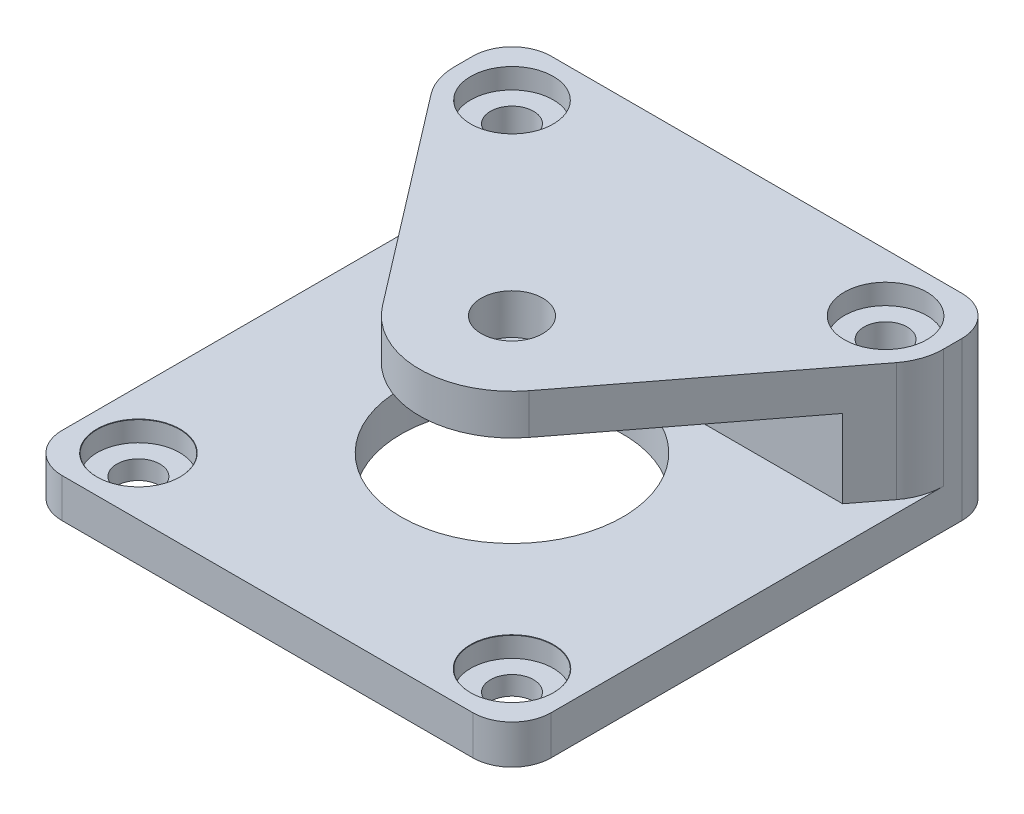
ISO-10303-21;
HEADER;
FILE_DESCRIPTION(('STEP AP214'),'2;1');
FILE_NAME('part.step','',(''),(''),'','','');
FILE_SCHEMA(('AUTOMOTIVE_DESIGN { 1 0 10303 214 1 1 1 1 }'));
ENDSEC;
DATA;
#1=APPLICATION_CONTEXT('core data for automotive mechanical design processes');
#2=APPLICATION_PROTOCOL_DEFINITION('international standard','automotive_design',2000,#1);
#3=PRODUCT_CONTEXT('',#1,'mechanical');
#4=PRODUCT('Part','Part','',(#3));
#5=PRODUCT_RELATED_PRODUCT_CATEGORY('part','',(#4));
#6=PRODUCT_DEFINITION_FORMATION('','',#4);
#7=PRODUCT_DEFINITION_CONTEXT('part definition',#1,'design');
#8=PRODUCT_DEFINITION('design','',#6,#7);
#9=PRODUCT_DEFINITION_SHAPE('','',#8);
#10=(LENGTH_UNIT() NAMED_UNIT(*) SI_UNIT(.MILLI.,.METRE.));
#11=(NAMED_UNIT(*) PLANE_ANGLE_UNIT() SI_UNIT($,.RADIAN.));
#12=(NAMED_UNIT(*) SI_UNIT($,.STERADIAN.) SOLID_ANGLE_UNIT());
#13=UNCERTAINTY_MEASURE_WITH_UNIT(LENGTH_MEASURE(1.E-05),#10,'distance_accuracy_value','');
#14=(GEOMETRIC_REPRESENTATION_CONTEXT(3) GLOBAL_UNCERTAINTY_ASSIGNED_CONTEXT((#13)) GLOBAL_UNIT_ASSIGNED_CONTEXT((#10,
#11,#12)) REPRESENTATION_CONTEXT('',''));
#15=CARTESIAN_POINT('',(0.,0.,0.));
#16=DIRECTION('',(0.,0.,1.));
#17=DIRECTION('',(1.,0.,0.));
#18=AXIS2_PLACEMENT_3D('',#15,#16,#17);
#19=CARTESIAN_POINT('',(0.,3.175,0.));
#20=DIRECTION('',(0.,-1.,0.));
#21=DIRECTION('',(0.,0.,-1.));
#22=AXIS2_PLACEMENT_3D('',#19,#20,#21);
#23=PLANE('',#22);
#24=CARTESIAN_POINT('',(35.005,3.175,-4.685));
#25=DIRECTION('',(0.,1.,0.));
#26=DIRECTION('',(0.,0.,1.));
#27=AXIS2_PLACEMENT_3D('',#24,#25,#26);
#28=CIRCLE('',#27,3.375);
#29=CARTESIAN_POINT('',(35.005,3.175,-1.30999999999999));
#30=VERTEX_POINT('',#29);
#31=EDGE_CURVE('E249',#30,#30,#28,.T.);
#32=ORIENTED_EDGE('',*,*,#31,.F.);
#33=EDGE_LOOP('',(#32));
#34=FACE_BOUND('',#33,.T.);
#35=DIRECTION('',(1.,0.,0.));
#36=VECTOR('',#35,1.);
#37=CARTESIAN_POINT('',(0.,3.175,0.));
#38=LINE('',#37,#36);
#39=CARTESIAN_POINT('',(3.175,3.175,0.));
#40=VERTEX_POINT('',#39);
#41=CARTESIAN_POINT('',(36.515,3.175,0.));
#42=VERTEX_POINT('',#41);
#43=EDGE_CURVE('E176',#40,#42,#38,.T.);
#44=ORIENTED_EDGE('',*,*,#43,.T.);
#45=CARTESIAN_POINT('',(36.515,3.175,-3.175));
#46=DIRECTION('',(0.,-1.,0.));
#47=DIRECTION('',(0.,0.,-1.));
#48=AXIS2_PLACEMENT_3D('',#45,#46,#47);
#49=CIRCLE('',#48,3.175);
#50=CARTESIAN_POINT('',(39.69,3.175,-3.175));
#51=VERTEX_POINT('',#50);
#52=EDGE_CURVE('E11',#42,#51,#49,.F.);
#53=ORIENTED_EDGE('',*,*,#52,.T.);
#54=DIRECTION('',(0.,0.,-1.));
#55=VECTOR('',#54,1.);
#56=CARTESIAN_POINT('',(39.69,3.175,0.));
#57=LINE('',#56,#55);
#58=CARTESIAN_POINT('',(39.69,3.175,-35.005));
#59=VERTEX_POINT('',#58);
#60=EDGE_CURVE('E173',#51,#59,#57,.T.);
#61=ORIENTED_EDGE('',*,*,#60,.T.);
#62=CARTESIAN_POINT('',(35.005,3.175,-35.005));
#63=DIRECTION('',(0.,1.,0.));
#64=DIRECTION('',(0.,0.,1.));
#65=AXIS2_PLACEMENT_3D('',#62,#63,#64);
#66=CIRCLE('',#65,4.68499999999999);
#67=CARTESIAN_POINT('',(38.724084904331,3.175,-32.1558540798378));
#68=VERTEX_POINT('',#67);
#69=EDGE_CURVE('E171',#68,#59,#66,.T.);
#70=ORIENTED_EDGE('',*,*,#69,.F.);
#71=DIRECTION('',(0.60814213877528,0.,-0.793828154606416));
#72=VECTOR('',#71,1.);
#73=CARTESIAN_POINT('',(25.7987111595481,3.175,-15.2839339591854));
#74=LINE('',#73,#72);
#75=CARTESIAN_POINT('',(36.8350239465929,3.175,-29.69));
#76=VERTEX_POINT('',#75);
#77=EDGE_CURVE('E163',#76,#68,#74,.T.);
#78=ORIENTED_EDGE('',*,*,#77,.F.);
#79=DIRECTION('',(-1.,0.,0.));
#80=VECTOR('',#79,1.);
#81=CARTESIAN_POINT('',(39.69,3.175,-29.69));
#82=LINE('',#81,#80);
#83=CARTESIAN_POINT('',(2.85497605340711,3.175,-29.69));
#84=VERTEX_POINT('',#83);
#85=EDGE_CURVE('E146',#76,#84,#82,.T.);
#86=ORIENTED_EDGE('',*,*,#85,.T.);
#87=DIRECTION('',(0.608142138775281,0.,0.793828154606415));
#88=VECTOR('',#87,1.);
#89=CARTESIAN_POINT('',(13.8912888404519,3.175,-15.2839339591854));
#90=LINE('',#89,#88);
#91=CARTESIAN_POINT('',(0.965915095668944,3.175,-32.1558540798378));
#92=VERTEX_POINT('',#91);
#93=EDGE_CURVE('E180',#92,#84,#90,.T.);
#94=ORIENTED_EDGE('',*,*,#93,.F.);
#95=CARTESIAN_POINT('',(4.685,3.175,-35.005));
#96=DIRECTION('',(0.,1.,0.));
#97=DIRECTION('',(0.,0.,1.));
#98=AXIS2_PLACEMENT_3D('',#95,#96,#97);
#99=CIRCLE('',#98,4.685);
#100=CARTESIAN_POINT('',(0.,3.175,-35.005));
#101=VERTEX_POINT('',#100);
#102=EDGE_CURVE('E320',#101,#92,#99,.T.);
#103=ORIENTED_EDGE('',*,*,#102,.F.);
#104=DIRECTION('',(0.,0.,1.));
#105=VECTOR('',#104,1.);
#106=CARTESIAN_POINT('',(0.,3.175,0.));
#107=LINE('',#106,#105);
#108=CARTESIAN_POINT('',(0.,3.175,-3.175));
#109=VERTEX_POINT('',#108);
#110=EDGE_CURVE('E220',#101,#109,#107,.T.);
#111=ORIENTED_EDGE('',*,*,#110,.T.);
#112=CARTESIAN_POINT('',(3.175,3.175,-3.175));
#113=DIRECTION('',(0.,-1.,0.));
#114=DIRECTION('',(0.,0.,-1.));
#115=AXIS2_PLACEMENT_3D('',#112,#113,#114);
#116=CIRCLE('',#115,3.175);
#117=EDGE_CURVE('E42',#109,#40,#116,.F.);
#118=ORIENTED_EDGE('',*,*,#117,.T.);
#119=EDGE_LOOP('',(#44,#53,#61,#70,#78,#86,#94,#103,#111,#118));
#120=FACE_BOUND('',#119,.T.);
#121=CARTESIAN_POINT('',(19.845,3.175,-19.845));
#122=DIRECTION('',(0.,1.,0.));
#123=DIRECTION('',(0.,0.,1.));
#124=AXIS2_PLACEMENT_3D('',#121,#122,#123);
#125=CIRCLE('',#124,9.);
#126=CARTESIAN_POINT('',(19.845,3.175,-10.845));
#127=VERTEX_POINT('',#126);
#128=EDGE_CURVE('E202',#127,#127,#125,.T.);
#129=ORIENTED_EDGE('',*,*,#128,.F.);
#130=EDGE_LOOP('',(#129));
#131=FACE_BOUND('',#130,.T.);
#132=CARTESIAN_POINT('',(4.68499999999999,3.175,-4.685));
#133=DIRECTION('',(0.,1.,0.));
#134=DIRECTION('',(0.,0.,1.));
#135=AXIS2_PLACEMENT_3D('',#132,#133,#134);
#136=CIRCLE('',#135,3.375);
#137=CARTESIAN_POINT('',(4.68499999999999,3.175,-1.31));
#138=VERTEX_POINT('',#137);
#139=EDGE_CURVE('E364',#138,#138,#136,.T.);
#140=ORIENTED_EDGE('',*,*,#139,.F.);
#141=EDGE_LOOP('',(#140));
#142=FACE_BOUND('',#141,.T.);
#143=ADVANCED_FACE('F34',(#34,#120,#131,#142),#23,.F.);
#144=CARTESIAN_POINT('',(13.8912888404519,12.81,-15.2839339591854));
#145=DIRECTION('',(0.793828154606415,0.,-0.608142138775281));
#146=DIRECTION('',(-0.608142138775281,0.,-0.793828154606415));
#147=AXIS2_PLACEMENT_3D('',#144,#145,#146);
#148=PLANE('',#147);
#149=DIRECTION('',(0.,-1.,0.));
#150=VECTOR('',#149,1.);
#151=CARTESIAN_POINT('',(2.85497605340711,12.81,-29.69));
#152=LINE('',#151,#150);
#153=CARTESIAN_POINT('',(2.85497605340711,9.525,-29.69));
#154=VERTEX_POINT('',#153);
#155=EDGE_CURVE('E153',#154,#84,#152,.T.);
#156=ORIENTED_EDGE('',*,*,#155,.F.);
#157=DIRECTION('',(-0.608142138775281,0.,-0.793828154606415));
#158=VECTOR('',#157,1.);
#159=CARTESIAN_POINT('',(13.8912888404519,9.525,-15.2839339591854));
#160=LINE('',#159,#158);
#161=CARTESIAN_POINT('',(13.8912888404519,9.525,-15.2839339591854));
#162=VERTEX_POINT('',#161);
#163=EDGE_CURVE('E324',#162,#154,#160,.T.);
#164=ORIENTED_EDGE('',*,*,#163,.F.);
#165=DIRECTION('',(0.,-1.,0.));
#166=VECTOR('',#165,1.);
#167=CARTESIAN_POINT('',(13.8912888404519,12.81,-15.2839339591854));
#168=LINE('',#167,#166);
#169=CARTESIAN_POINT('',(13.8912888404519,12.81,-15.2839339591854));
#170=VERTEX_POINT('',#169);
#171=EDGE_CURVE('E195',#170,#162,#168,.T.);
#172=ORIENTED_EDGE('',*,*,#171,.F.);
#173=DIRECTION('',(0.608142138775281,0.,0.793828154606415));
#174=VECTOR('',#173,1.);
#175=CARTESIAN_POINT('',(13.8912888404519,12.81,-15.2839339591854));
#176=LINE('',#175,#174);
#177=CARTESIAN_POINT('',(0.965915095668944,12.81,-32.1558540798378));
#178=VERTEX_POINT('',#177);
#179=EDGE_CURVE('E311',#178,#170,#176,.T.);
#180=ORIENTED_EDGE('',*,*,#179,.F.);
#181=DIRECTION('',(0.,-1.,0.));
#182=VECTOR('',#181,1.);
#183=CARTESIAN_POINT('',(0.965915095668944,12.81,-32.1558540798378));
#184=LINE('',#183,#182);
#185=EDGE_CURVE('E198',#178,#92,#184,.T.);
#186=ORIENTED_EDGE('',*,*,#185,.T.);
#187=ORIENTED_EDGE('',*,*,#93,.T.);
#188=EDGE_LOOP('',(#156,#164,#172,#180,#186,#187));
#189=FACE_BOUND('',#188,.T.);
#190=ADVANCED_FACE('F337',(#189),#148,.F.);
#191=CARTESIAN_POINT('',(19.845,12.81,-19.845));
#192=DIRECTION('',(0.,-1.,0.));
#193=DIRECTION('',(0.,0.,-1.));
#194=AXIS2_PLACEMENT_3D('',#191,#192,#193);
#195=CYLINDRICAL_SURFACE('',#194,7.49999999999999);
#196=CARTESIAN_POINT('',(19.845,9.525,-19.845));
#197=DIRECTION('',(0.,-1.,0.));
#198=DIRECTION('',(0.,0.,-1.));
#199=AXIS2_PLACEMENT_3D('',#196,#197,#198);
#200=CIRCLE('',#199,7.49999999999999);
#201=CARTESIAN_POINT('',(25.7987111595481,9.525,-15.2839339591854));
#202=VERTEX_POINT('',#201);
#203=EDGE_CURVE('E326',#202,#162,#200,.T.);
#204=ORIENTED_EDGE('',*,*,#203,.F.);
#205=DIRECTION('',(0.,-1.,0.));
#206=VECTOR('',#205,1.);
#207=CARTESIAN_POINT('',(25.7987111595481,12.81,-15.2839339591854));
#208=LINE('',#207,#206);
#209=CARTESIAN_POINT('',(25.7987111595481,12.81,-15.2839339591854));
#210=VERTEX_POINT('',#209);
#211=EDGE_CURVE('E193',#210,#202,#208,.T.);
#212=ORIENTED_EDGE('',*,*,#211,.F.);
#213=CARTESIAN_POINT('',(19.845,12.81,-19.845));
#214=DIRECTION('',(0.,1.,0.));
#215=DIRECTION('',(0.,0.,1.));
#216=AXIS2_PLACEMENT_3D('',#213,#214,#215);
#217=CIRCLE('',#216,7.49999999999999);
#218=EDGE_CURVE('E307',#170,#210,#217,.T.);
#219=ORIENTED_EDGE('',*,*,#218,.F.);
#220=ORIENTED_EDGE('',*,*,#171,.T.);
#221=EDGE_LOOP('',(#204,#212,#219,#220));
#222=FACE_BOUND('',#221,.T.);
#223=ADVANCED_FACE('F340',(#222),#195,.T.);
#224=CARTESIAN_POINT('',(25.7987111595481,12.81,-15.2839339591854));
#225=DIRECTION('',(-0.793828154606416,0.,-0.60814213877528));
#226=DIRECTION('',(-0.60814213877528,0.,0.793828154606416));
#227=AXIS2_PLACEMENT_3D('',#224,#225,#226);
#228=PLANE('',#227);
#229=DIRECTION('',(0.,1.,0.));
#230=VECTOR('',#229,1.);
#231=CARTESIAN_POINT('',(36.8350239465929,12.81,-29.69));
#232=LINE('',#231,#230);
#233=CARTESIAN_POINT('',(36.8350239465929,9.525,-29.69));
#234=VERTEX_POINT('',#233);
#235=EDGE_CURVE('E150',#76,#234,#232,.T.);
#236=ORIENTED_EDGE('',*,*,#235,.F.);
#237=ORIENTED_EDGE('',*,*,#77,.T.);
#238=DIRECTION('',(0.,-1.,0.));
#239=VECTOR('',#238,1.);
#240=CARTESIAN_POINT('',(38.724084904331,12.81,-32.1558540798378));
#241=LINE('',#240,#239);
#242=CARTESIAN_POINT('',(38.724084904331,12.81,-32.1558540798378));
#243=VERTEX_POINT('',#242);
#244=EDGE_CURVE('E191',#243,#68,#241,.T.);
#245=ORIENTED_EDGE('',*,*,#244,.F.);
#246=DIRECTION('',(0.60814213877528,0.,-0.793828154606416));
#247=VECTOR('',#246,1.);
#248=CARTESIAN_POINT('',(25.7987111595481,12.81,-15.2839339591854));
#249=LINE('',#248,#247);
#250=EDGE_CURVE('E304',#210,#243,#249,.T.);
#251=ORIENTED_EDGE('',*,*,#250,.F.);
#252=ORIENTED_EDGE('',*,*,#211,.T.);
#253=DIRECTION('',(-0.60814213877528,0.,0.793828154606416));
#254=VECTOR('',#253,1.);
#255=CARTESIAN_POINT('',(25.7987111595481,9.525,-15.2839339591854));
#256=LINE('',#255,#254);
#257=EDGE_CURVE('E166',#234,#202,#256,.T.);
#258=ORIENTED_EDGE('',*,*,#257,.F.);
#259=EDGE_LOOP('',(#236,#237,#245,#251,#252,#258));
#260=FACE_BOUND('',#259,.T.);
#261=ADVANCED_FACE('F161',(#260),#228,.F.);
#262=CARTESIAN_POINT('',(0.,0.,0.));
#263=DIRECTION('',(0.,-1.,0.));
#264=DIRECTION('',(0.,0.,-1.));
#265=AXIS2_PLACEMENT_3D('',#262,#263,#264);
#266=PLANE('',#265);
#267=CARTESIAN_POINT('',(4.685,0.,-35.005));
#268=DIRECTION('',(0.,1.,0.));
#269=DIRECTION('',(0.,0.,1.));
#270=AXIS2_PLACEMENT_3D('',#267,#268,#269);
#271=CIRCLE('',#270,1.75);
#272=CARTESIAN_POINT('',(4.685,0.,-33.255));
#273=VERTEX_POINT('',#272);
#274=EDGE_CURVE('E205',#273,#273,#271,.T.);
#275=ORIENTED_EDGE('',*,*,#274,.T.);
#276=EDGE_LOOP('',(#275));
#277=FACE_BOUND('',#276,.T.);
#278=CARTESIAN_POINT('',(35.005,0.,-4.685));
#279=DIRECTION('',(0.,1.,0.));
#280=DIRECTION('',(0.,0.,1.));
#281=AXIS2_PLACEMENT_3D('',#278,#279,#280);
#282=CIRCLE('',#281,1.75);
#283=CARTESIAN_POINT('',(35.005,0.,-2.93499999999999));
#284=VERTEX_POINT('',#283);
#285=EDGE_CURVE('E213',#284,#284,#282,.T.);
#286=ORIENTED_EDGE('',*,*,#285,.T.);
#287=EDGE_LOOP('',(#286));
#288=FACE_BOUND('',#287,.T.);
#289=DIRECTION('',(0.,0.,1.));
#290=VECTOR('',#289,1.);
#291=CARTESIAN_POINT('',(0.,0.,0.));
#292=LINE('',#291,#290);
#293=CARTESIAN_POINT('',(0.,0.,-36.515));
#294=VERTEX_POINT('',#293);
#295=CARTESIAN_POINT('',(0.,0.,-3.175));
#296=VERTEX_POINT('',#295);
#297=EDGE_CURVE('E219',#294,#296,#292,.T.);
#298=ORIENTED_EDGE('',*,*,#297,.F.);
#299=CARTESIAN_POINT('',(3.175,0.,-36.515));
#300=DIRECTION('',(0.,-1.,0.));
#301=DIRECTION('',(0.,0.,-1.));
#302=AXIS2_PLACEMENT_3D('',#299,#300,#301);
#303=CIRCLE('',#302,3.175);
#304=CARTESIAN_POINT('',(3.175,0.,-39.69));
#305=VERTEX_POINT('',#304);
#306=EDGE_CURVE('E261',#294,#305,#303,.T.);
#307=ORIENTED_EDGE('',*,*,#306,.T.);
#308=DIRECTION('',(-1.,0.,0.));
#309=VECTOR('',#308,1.);
#310=CARTESIAN_POINT('',(0.,0.,-39.69));
#311=LINE('',#310,#309);
#312=CARTESIAN_POINT('',(36.515,0.,-39.69));
#313=VERTEX_POINT('',#312);
#314=EDGE_CURVE('E222',#313,#305,#311,.T.);
#315=ORIENTED_EDGE('',*,*,#314,.F.);
#316=CARTESIAN_POINT('',(36.515,0.,-36.515));
#317=DIRECTION('',(0.,-1.,0.));
#318=DIRECTION('',(0.,0.,-1.));
#319=AXIS2_PLACEMENT_3D('',#316,#317,#318);
#320=CIRCLE('',#319,3.175);
#321=CARTESIAN_POINT('',(39.69,0.,-36.515));
#322=VERTEX_POINT('',#321);
#323=EDGE_CURVE('E259',#313,#322,#320,.T.);
#324=ORIENTED_EDGE('',*,*,#323,.T.);
#325=DIRECTION('',(0.,0.,-1.));
#326=VECTOR('',#325,1.);
#327=CARTESIAN_POINT('',(39.69,0.,0.));
#328=LINE('',#327,#326);
#329=CARTESIAN_POINT('',(39.69,0.,-3.175));
#330=VERTEX_POINT('',#329);
#331=EDGE_CURVE('E228',#330,#322,#328,.T.);
#332=ORIENTED_EDGE('',*,*,#331,.F.);
#333=CARTESIAN_POINT('',(36.515,0.,-3.175));
#334=DIRECTION('',(0.,-1.,0.));
#335=DIRECTION('',(0.,0.,-1.));
#336=AXIS2_PLACEMENT_3D('',#333,#334,#335);
#337=CIRCLE('',#336,3.175);
#338=CARTESIAN_POINT('',(36.515,0.,0.));
#339=VERTEX_POINT('',#338);
#340=EDGE_CURVE('E257',#330,#339,#337,.T.);
#341=ORIENTED_EDGE('',*,*,#340,.T.);
#342=DIRECTION('',(1.,0.,0.));
#343=VECTOR('',#342,1.);
#344=CARTESIAN_POINT('',(0.,0.,0.));
#345=LINE('',#344,#343);
#346=CARTESIAN_POINT('',(3.175,0.,0.));
#347=VERTEX_POINT('',#346);
#348=EDGE_CURVE('E226',#347,#339,#345,.T.);
#349=ORIENTED_EDGE('',*,*,#348,.F.);
#350=CARTESIAN_POINT('',(3.175,0.,-3.175));
#351=DIRECTION('',(0.,-1.,0.));
#352=DIRECTION('',(0.,0.,-1.));
#353=AXIS2_PLACEMENT_3D('',#350,#351,#352);
#354=CIRCLE('',#353,3.175);
#355=EDGE_CURVE('E255',#347,#296,#354,.T.);
#356=ORIENTED_EDGE('',*,*,#355,.T.);
#357=EDGE_LOOP('',(#298,#307,#315,#324,#332,#341,#349,#356));
#358=FACE_BOUND('',#357,.T.);
#359=CARTESIAN_POINT('',(4.68499999999999,0.,-4.685));
#360=DIRECTION('',(0.,1.,0.));
#361=DIRECTION('',(0.,0.,1.));
#362=AXIS2_PLACEMENT_3D('',#359,#360,#361);
#363=CIRCLE('',#362,1.75);
#364=CARTESIAN_POINT('',(4.68499999999999,0.,-2.93499999999999));
#365=VERTEX_POINT('',#364);
#366=EDGE_CURVE('E216',#365,#365,#363,.T.);
#367=ORIENTED_EDGE('',*,*,#366,.T.);
#368=EDGE_LOOP('',(#367));
#369=FACE_BOUND('',#368,.T.);
#370=CARTESIAN_POINT('',(35.005,0.,-35.005));
#371=DIRECTION('',(0.,1.,0.));
#372=DIRECTION('',(0.,0.,1.));
#373=AXIS2_PLACEMENT_3D('',#370,#371,#372);
#374=CIRCLE('',#373,1.75);
#375=CARTESIAN_POINT('',(35.005,0.,-33.255));
#376=VERTEX_POINT('',#375);
#377=EDGE_CURVE('E210',#376,#376,#374,.T.);
#378=ORIENTED_EDGE('',*,*,#377,.T.);
#379=EDGE_LOOP('',(#378));
#380=FACE_BOUND('',#379,.T.);
#381=CARTESIAN_POINT('',(19.845,0.,-19.845));
#382=DIRECTION('',(0.,1.,0.));
#383=DIRECTION('',(0.,0.,1.));
#384=AXIS2_PLACEMENT_3D('',#381,#382,#383);
#385=CIRCLE('',#384,9.);
#386=CARTESIAN_POINT('',(19.845,0.,-10.845));
#387=VERTEX_POINT('',#386);
#388=EDGE_CURVE('E201',#387,#387,#385,.T.);
#389=ORIENTED_EDGE('',*,*,#388,.T.);
#390=EDGE_LOOP('',(#389));
#391=FACE_BOUND('',#390,.T.);
#392=ADVANCED_FACE('F286',(#277,#288,#358,#369,#380,#391),#266,.T.);
#393=CARTESIAN_POINT('',(0.,3.175,0.));
#394=DIRECTION('',(1.,0.,0.));
#395=DIRECTION('',(0.,0.,-1.));
#396=AXIS2_PLACEMENT_3D('',#393,#394,#395);
#397=PLANE('',#396);
#398=DIRECTION('',(0.,0.,1.));
#399=VECTOR('',#398,1.);
#400=CARTESIAN_POINT('',(0.,12.81,-35.005));
#401=LINE('',#400,#399);
#402=CARTESIAN_POINT('',(0.,12.81,-36.515));
#403=VERTEX_POINT('',#402);
#404=CARTESIAN_POINT('',(0.,12.81,-35.005));
#405=VERTEX_POINT('',#404);
#406=EDGE_CURVE('E188',#403,#405,#401,.T.);
#407=ORIENTED_EDGE('',*,*,#406,.F.);
#408=DIRECTION('',(0.,-1.,0.));
#409=VECTOR('',#408,1.);
#410=CARTESIAN_POINT('',(0.,3.175,-36.515));
#411=LINE('',#410,#409);
#412=EDGE_CURVE('E252',#403,#294,#411,.T.);
#413=ORIENTED_EDGE('',*,*,#412,.T.);
#414=ORIENTED_EDGE('',*,*,#297,.T.);
#415=DIRECTION('',(0.,-1.,0.));
#416=VECTOR('',#415,1.);
#417=CARTESIAN_POINT('',(0.,3.175,-3.175));
#418=LINE('',#417,#416);
#419=EDGE_CURVE('E167',#296,#109,#418,.F.);
#420=ORIENTED_EDGE('',*,*,#419,.T.);
#421=ORIENTED_EDGE('',*,*,#110,.F.);
#422=DIRECTION('',(0.,-1.,0.));
#423=VECTOR('',#422,1.);
#424=CARTESIAN_POINT('',(0.,12.81,-35.005));
#425=LINE('',#424,#423);
#426=EDGE_CURVE('E184',#405,#101,#425,.T.);
#427=ORIENTED_EDGE('',*,*,#426,.F.);
#428=EDGE_LOOP('',(#407,#413,#414,#420,#421,#427));
#429=FACE_BOUND('',#428,.T.);
#430=ADVANCED_FACE('F416',(#429),#397,.F.);
#431=CARTESIAN_POINT('',(0.,3.175,0.));
#432=DIRECTION('',(0.,0.,-1.));
#433=DIRECTION('',(-1.,0.,0.));
#434=AXIS2_PLACEMENT_3D('',#431,#432,#433);
#435=PLANE('',#434);
#436=ORIENTED_EDGE('',*,*,#348,.T.);
#437=DIRECTION('',(0.,-1.,0.));
#438=VECTOR('',#437,1.);
#439=CARTESIAN_POINT('',(36.515,3.175,0.));
#440=LINE('',#439,#438);
#441=EDGE_CURVE('E49',#339,#42,#440,.F.);
#442=ORIENTED_EDGE('',*,*,#441,.T.);
#443=ORIENTED_EDGE('',*,*,#43,.F.);
#444=DIRECTION('',(0.,-1.,0.));
#445=VECTOR('',#444,1.);
#446=CARTESIAN_POINT('',(3.175,3.175,0.));
#447=LINE('',#446,#445);
#448=EDGE_CURVE('E277',#40,#347,#447,.T.);
#449=ORIENTED_EDGE('',*,*,#448,.T.);
#450=EDGE_LOOP('',(#436,#442,#443,#449));
#451=FACE_BOUND('',#450,.T.);
#452=ADVANCED_FACE('F282',(#451),#435,.F.);
#453=CARTESIAN_POINT('',(39.69,3.175,0.));
#454=DIRECTION('',(-1.,0.,0.));
#455=DIRECTION('',(0.,0.,1.));
#456=AXIS2_PLACEMENT_3D('',#453,#454,#455);
#457=PLANE('',#456);
#458=ORIENTED_EDGE('',*,*,#331,.T.);
#459=DIRECTION('',(0.,-1.,0.));
#460=VECTOR('',#459,1.);
#461=CARTESIAN_POINT('',(39.69,3.175,-36.515));
#462=LINE('',#461,#460);
#463=CARTESIAN_POINT('',(39.69,12.81,-36.515));
#464=VERTEX_POINT('',#463);
#465=EDGE_CURVE('E275',#322,#464,#462,.F.);
#466=ORIENTED_EDGE('',*,*,#465,.T.);
#467=DIRECTION('',(0.,0.,-1.));
#468=VECTOR('',#467,1.);
#469=CARTESIAN_POINT('',(39.69,12.81,-39.69));
#470=LINE('',#469,#468);
#471=CARTESIAN_POINT('',(39.69,12.81,-35.005));
#472=VERTEX_POINT('',#471);
#473=EDGE_CURVE('E309',#472,#464,#470,.T.);
#474=ORIENTED_EDGE('',*,*,#473,.F.);
#475=DIRECTION('',(0.,-1.,0.));
#476=VECTOR('',#475,1.);
#477=CARTESIAN_POINT('',(39.69,12.81,-35.005));
#478=LINE('',#477,#476);
#479=EDGE_CURVE('E187',#472,#59,#478,.T.);
#480=ORIENTED_EDGE('',*,*,#479,.T.);
#481=ORIENTED_EDGE('',*,*,#60,.F.);
#482=DIRECTION('',(0.,-1.,0.));
#483=VECTOR('',#482,1.);
#484=CARTESIAN_POINT('',(39.69,3.175,-3.175));
#485=LINE('',#484,#483);
#486=EDGE_CURVE('E272',#51,#330,#485,.T.);
#487=ORIENTED_EDGE('',*,*,#486,.T.);
#488=EDGE_LOOP('',(#458,#466,#474,#480,#481,#487));
#489=FACE_BOUND('',#488,.T.);
#490=ADVANCED_FACE('F295',(#489),#457,.F.);
#491=CARTESIAN_POINT('',(0.,3.175,-39.69));
#492=DIRECTION('',(0.,0.,1.));
#493=DIRECTION('',(1.,0.,0.));
#494=AXIS2_PLACEMENT_3D('',#491,#492,#493);
#495=PLANE('',#494);
#496=ORIENTED_EDGE('',*,*,#314,.T.);
#497=DIRECTION('',(0.,-1.,0.));
#498=VECTOR('',#497,1.);
#499=CARTESIAN_POINT('',(3.175,3.175,-39.69));
#500=LINE('',#499,#498);
#501=CARTESIAN_POINT('',(3.175,12.81,-39.69));
#502=VERTEX_POINT('',#501);
#503=EDGE_CURVE('E266',#305,#502,#500,.F.);
#504=ORIENTED_EDGE('',*,*,#503,.T.);
#505=DIRECTION('',(-1.,0.,0.));
#506=VECTOR('',#505,1.);
#507=CARTESIAN_POINT('',(35.005,12.81,-39.69));
#508=LINE('',#507,#506);
#509=CARTESIAN_POINT('',(36.515,12.81,-39.69));
#510=VERTEX_POINT('',#509);
#511=EDGE_CURVE('E317',#510,#502,#508,.T.);
#512=ORIENTED_EDGE('',*,*,#511,.F.);
#513=DIRECTION('',(0.,-1.,0.));
#514=VECTOR('',#513,1.);
#515=CARTESIAN_POINT('',(36.515,3.175,-39.69));
#516=LINE('',#515,#514);
#517=EDGE_CURVE('E263',#510,#313,#516,.T.);
#518=ORIENTED_EDGE('',*,*,#517,.T.);
#519=EDGE_LOOP('',(#496,#504,#512,#518));
#520=FACE_BOUND('',#519,.T.);
#521=ADVANCED_FACE('F418',(#520),#495,.F.);
#522=CARTESIAN_POINT('',(4.68499999999999,3.175,-4.685));
#523=DIRECTION('',(0.,-1.,0.));
#524=DIRECTION('',(0.,0.,-1.));
#525=AXIS2_PLACEMENT_3D('',#522,#523,#524);
#526=CYLINDRICAL_SURFACE('',#525,1.75);
#527=CARTESIAN_POINT('',(4.68499999999999,1.525,-4.685));
#528=DIRECTION('',(0.,-1.,0.));
#529=DIRECTION('',(0.,0.,-1.));
#530=AXIS2_PLACEMENT_3D('',#527,#528,#529);
#531=CIRCLE('',#530,1.75);
#532=CARTESIAN_POINT('',(4.68499999999999,1.525,-6.43499999999999));
#533=VERTEX_POINT('',#532);
#534=EDGE_CURVE('E246',#533,#533,#531,.T.);
#535=ORIENTED_EDGE('',*,*,#534,.F.);
#536=EDGE_LOOP('',(#535));
#537=FACE_BOUND('',#536,.T.);
#538=ORIENTED_EDGE('',*,*,#366,.F.);
#539=EDGE_LOOP('',(#538));
#540=FACE_BOUND('',#539,.T.);
#541=ADVANCED_FACE('F412',(#537,#540),#526,.F.);
#542=CARTESIAN_POINT('',(35.005,3.175,-4.685));
#543=DIRECTION('',(0.,-1.,0.));
#544=DIRECTION('',(0.,0.,-1.));
#545=AXIS2_PLACEMENT_3D('',#542,#543,#544);
#546=CYLINDRICAL_SURFACE('',#545,1.75);
#547=CARTESIAN_POINT('',(35.005,1.525,-4.685));
#548=DIRECTION('',(0.,-1.,0.));
#549=DIRECTION('',(0.,0.,-1.));
#550=AXIS2_PLACEMENT_3D('',#547,#548,#549);
#551=CIRCLE('',#550,1.75);
#552=CARTESIAN_POINT('',(35.005,1.525,-6.435));
#553=VERTEX_POINT('',#552);
#554=EDGE_CURVE('E241',#553,#553,#551,.T.);
#555=ORIENTED_EDGE('',*,*,#554,.F.);
#556=EDGE_LOOP('',(#555));
#557=FACE_BOUND('',#556,.T.);
#558=ORIENTED_EDGE('',*,*,#285,.F.);
#559=EDGE_LOOP('',(#558));
#560=FACE_BOUND('',#559,.T.);
#561=ADVANCED_FACE('F474',(#557,#560),#546,.F.);
#562=CARTESIAN_POINT('',(35.005,3.175,-35.005));
#563=DIRECTION('',(0.,-1.,0.));
#564=DIRECTION('',(0.,0.,-1.));
#565=AXIS2_PLACEMENT_3D('',#562,#563,#564);
#566=CYLINDRICAL_SURFACE('',#565,1.75);
#567=CARTESIAN_POINT('',(35.005,11.16,-35.005));
#568=DIRECTION('',(0.,-1.,0.));
#569=DIRECTION('',(0.,0.,-1.));
#570=AXIS2_PLACEMENT_3D('',#567,#568,#569);
#571=CIRCLE('',#570,1.75);
#572=CARTESIAN_POINT('',(35.005,11.16,-36.755));
#573=VERTEX_POINT('',#572);
#574=EDGE_CURVE('E157',#573,#573,#571,.T.);
#575=ORIENTED_EDGE('',*,*,#574,.F.);
#576=EDGE_LOOP('',(#575));
#577=FACE_BOUND('',#576,.T.);
#578=ORIENTED_EDGE('',*,*,#377,.F.);
#579=EDGE_LOOP('',(#578));
#580=FACE_BOUND('',#579,.T.);
#581=ADVANCED_FACE('F471',(#577,#580),#566,.F.);
#582=CARTESIAN_POINT('',(4.685,3.175,-35.005));
#583=DIRECTION('',(0.,-1.,0.));
#584=DIRECTION('',(0.,0.,-1.));
#585=AXIS2_PLACEMENT_3D('',#582,#583,#584);
#586=CYLINDRICAL_SURFACE('',#585,1.75);
#587=CARTESIAN_POINT('',(4.685,11.16,-35.005));
#588=DIRECTION('',(0.,-1.,0.));
#589=DIRECTION('',(0.,0.,-1.));
#590=AXIS2_PLACEMENT_3D('',#587,#588,#589);
#591=CIRCLE('',#590,1.75);
#592=CARTESIAN_POINT('',(4.685,11.16,-36.755));
#593=VERTEX_POINT('',#592);
#594=EDGE_CURVE('E236',#593,#593,#591,.T.);
#595=ORIENTED_EDGE('',*,*,#594,.F.);
#596=EDGE_LOOP('',(#595));
#597=FACE_BOUND('',#596,.T.);
#598=ORIENTED_EDGE('',*,*,#274,.F.);
#599=EDGE_LOOP('',(#598));
#600=FACE_BOUND('',#599,.T.);
#601=ADVANCED_FACE('F467',(#597,#600),#586,.F.);
#602=CARTESIAN_POINT('',(19.845,3.175,-19.845));
#603=DIRECTION('',(0.,-1.,0.));
#604=DIRECTION('',(0.,0.,-1.));
#605=AXIS2_PLACEMENT_3D('',#602,#603,#604);
#606=CYLINDRICAL_SURFACE('',#605,9.);
#607=ORIENTED_EDGE('',*,*,#128,.T.);
#608=EDGE_LOOP('',(#607));
#609=FACE_BOUND('',#608,.T.);
#610=ORIENTED_EDGE('',*,*,#388,.F.);
#611=EDGE_LOOP('',(#610));
#612=FACE_BOUND('',#611,.T.);
#613=ADVANCED_FACE('F379',(#609,#612),#606,.F.);
#614=CARTESIAN_POINT('',(4.685,12.81,-35.005));
#615=DIRECTION('',(0.,1.,0.));
#616=DIRECTION('',(0.,0.,1.));
#617=AXIS2_PLACEMENT_3D('',#614,#615,#616);
#618=PLANE('',#617);
#619=CARTESIAN_POINT('',(19.845,12.81,-19.845));
#620=DIRECTION('',(0.,1.,0.));
#621=DIRECTION('',(0.,0.,1.));
#622=AXIS2_PLACEMENT_3D('',#619,#620,#621);
#623=CIRCLE('',#622,2.5);
#624=CARTESIAN_POINT('',(19.845,12.81,-17.345));
#625=VERTEX_POINT('',#624);
#626=EDGE_CURVE('E367',#625,#625,#623,.T.);
#627=ORIENTED_EDGE('',*,*,#626,.F.);
#628=EDGE_LOOP('',(#627));
#629=FACE_BOUND('',#628,.T.);
#630=CARTESIAN_POINT('',(4.685,12.81,-35.005));
#631=DIRECTION('',(0.,1.,0.));
#632=DIRECTION('',(0.,0.,1.));
#633=AXIS2_PLACEMENT_3D('',#630,#631,#632);
#634=CIRCLE('',#633,3.35);
#635=CARTESIAN_POINT('',(4.685,12.81,-31.655));
#636=VERTEX_POINT('',#635);
#637=EDGE_CURVE('E244',#636,#636,#634,.T.);
#638=ORIENTED_EDGE('',*,*,#637,.F.);
#639=EDGE_LOOP('',(#638));
#640=FACE_BOUND('',#639,.T.);
#641=CARTESIAN_POINT('',(35.005,12.81,-35.005));
#642=DIRECTION('',(0.,1.,0.));
#643=DIRECTION('',(0.,0.,1.));
#644=AXIS2_PLACEMENT_3D('',#641,#642,#643);
#645=CIRCLE('',#644,3.35);
#646=CARTESIAN_POINT('',(35.005,12.81,-31.655));
#647=VERTEX_POINT('',#646);
#648=EDGE_CURVE('E239',#647,#647,#645,.T.);
#649=ORIENTED_EDGE('',*,*,#648,.F.);
#650=EDGE_LOOP('',(#649));
#651=FACE_BOUND('',#650,.T.);
#652=ORIENTED_EDGE('',*,*,#511,.T.);
#653=CARTESIAN_POINT('',(3.175,12.81,-36.515));
#654=DIRECTION('',(0.,1.,0.));
#655=DIRECTION('',(0.,0.,1.));
#656=AXIS2_PLACEMENT_3D('',#653,#654,#655);
#657=CIRCLE('',#656,3.175);
#658=EDGE_CURVE('E270',#502,#403,#657,.T.);
#659=ORIENTED_EDGE('',*,*,#658,.T.);
#660=ORIENTED_EDGE('',*,*,#406,.T.);
#661=CARTESIAN_POINT('',(4.685,12.81,-35.005));
#662=DIRECTION('',(0.,1.,0.));
#663=DIRECTION('',(0.,0.,1.));
#664=AXIS2_PLACEMENT_3D('',#661,#662,#663);
#665=CIRCLE('',#664,4.685);
#666=EDGE_CURVE('E183',#405,#178,#665,.T.);
#667=ORIENTED_EDGE('',*,*,#666,.T.);
#668=ORIENTED_EDGE('',*,*,#179,.T.);
#669=ORIENTED_EDGE('',*,*,#218,.T.);
#670=ORIENTED_EDGE('',*,*,#250,.T.);
#671=CARTESIAN_POINT('',(35.005,12.81,-35.005));
#672=DIRECTION('',(0.,1.,0.));
#673=DIRECTION('',(0.,0.,1.));
#674=AXIS2_PLACEMENT_3D('',#671,#672,#673);
#675=CIRCLE('',#674,4.68499999999999);
#676=EDGE_CURVE('E302',#243,#472,#675,.T.);
#677=ORIENTED_EDGE('',*,*,#676,.T.);
#678=ORIENTED_EDGE('',*,*,#473,.T.);
#679=CARTESIAN_POINT('',(36.515,12.81,-36.515));
#680=DIRECTION('',(0.,1.,0.));
#681=DIRECTION('',(0.,0.,1.));
#682=AXIS2_PLACEMENT_3D('',#679,#680,#681);
#683=CIRCLE('',#682,3.175);
#684=EDGE_CURVE('E268',#464,#510,#683,.T.);
#685=ORIENTED_EDGE('',*,*,#684,.T.);
#686=EDGE_LOOP('',(#652,#659,#660,#667,#668,#669,#670,#677,#678,#685));
#687=FACE_BOUND('',#686,.T.);
#688=ADVANCED_FACE('F332',(#629,#640,#651,#687),#618,.T.);
#689=CARTESIAN_POINT('',(4.685,12.81,-35.005));
#690=DIRECTION('',(0.,-1.,0.));
#691=DIRECTION('',(0.,0.,-1.));
#692=AXIS2_PLACEMENT_3D('',#689,#690,#691);
#693=CYLINDRICAL_SURFACE('',#692,4.685);
#694=ORIENTED_EDGE('',*,*,#102,.T.);
#695=ORIENTED_EDGE('',*,*,#185,.F.);
#696=ORIENTED_EDGE('',*,*,#666,.F.);
#697=ORIENTED_EDGE('',*,*,#426,.T.);
#698=EDGE_LOOP('',(#694,#695,#696,#697));
#699=FACE_BOUND('',#698,.T.);
#700=ADVANCED_FACE('F378',(#699),#693,.T.);
#701=CARTESIAN_POINT('',(35.005,12.81,-35.005));
#702=DIRECTION('',(0.,-1.,0.));
#703=DIRECTION('',(0.,0.,-1.));
#704=AXIS2_PLACEMENT_3D('',#701,#702,#703);
#705=CYLINDRICAL_SURFACE('',#704,4.68499999999999);
#706=ORIENTED_EDGE('',*,*,#69,.T.);
#707=ORIENTED_EDGE('',*,*,#479,.F.);
#708=ORIENTED_EDGE('',*,*,#676,.F.);
#709=ORIENTED_EDGE('',*,*,#244,.T.);
#710=EDGE_LOOP('',(#706,#707,#708,#709));
#711=FACE_BOUND('',#710,.T.);
#712=ADVANCED_FACE('F300',(#711),#705,.T.);
#713=CARTESIAN_POINT('',(39.69,3.175,-29.69));
#714=DIRECTION('',(0.,0.,1.));
#715=DIRECTION('',(1.,0.,0.));
#716=AXIS2_PLACEMENT_3D('',#713,#714,#715);
#717=PLANE('',#716);
#718=ORIENTED_EDGE('',*,*,#155,.T.);
#719=ORIENTED_EDGE('',*,*,#85,.F.);
#720=ORIENTED_EDGE('',*,*,#235,.T.);
#721=DIRECTION('',(-1.,0.,0.));
#722=VECTOR('',#721,1.);
#723=CARTESIAN_POINT('',(39.69,9.525,-29.69));
#724=LINE('',#723,#722);
#725=EDGE_CURVE('E156',#234,#154,#724,.T.);
#726=ORIENTED_EDGE('',*,*,#725,.T.);
#727=EDGE_LOOP('',(#718,#719,#720,#726));
#728=FACE_BOUND('',#727,.T.);
#729=ADVANCED_FACE('F148',(#728),#717,.T.);
#730=CARTESIAN_POINT('',(39.69,9.525,-29.69));
#731=DIRECTION('',(0.,-1.,0.));
#732=DIRECTION('',(0.,0.,-1.));
#733=AXIS2_PLACEMENT_3D('',#730,#731,#732);
#734=PLANE('',#733);
#735=CARTESIAN_POINT('',(19.845,9.525,-19.845));
#736=DIRECTION('',(0.,-1.,0.));
#737=DIRECTION('',(0.,0.,-1.));
#738=AXIS2_PLACEMENT_3D('',#735,#736,#737);
#739=CIRCLE('',#738,2.5);
#740=CARTESIAN_POINT('',(19.845,9.525,-22.345));
#741=VERTEX_POINT('',#740);
#742=EDGE_CURVE('E368',#741,#741,#739,.F.);
#743=ORIENTED_EDGE('',*,*,#742,.T.);
#744=EDGE_LOOP('',(#743));
#745=FACE_BOUND('',#744,.T.);
#746=ORIENTED_EDGE('',*,*,#163,.T.);
#747=ORIENTED_EDGE('',*,*,#725,.F.);
#748=ORIENTED_EDGE('',*,*,#257,.T.);
#749=ORIENTED_EDGE('',*,*,#203,.T.);
#750=EDGE_LOOP('',(#746,#747,#748,#749));
#751=FACE_BOUND('',#750,.T.);
#752=ADVANCED_FACE('F398',(#745,#751),#734,.T.);
#753=CARTESIAN_POINT('',(36.705,11.16,-35.005));
#754=DIRECTION('',(0.,-1.,0.));
#755=DIRECTION('',(0.,0.,-1.));
#756=AXIS2_PLACEMENT_3D('',#753,#754,#755);
#757=PLANE('',#756);
#758=ORIENTED_EDGE('',*,*,#574,.T.);
#759=EDGE_LOOP('',(#758));
#760=FACE_BOUND('',#759,.T.);
#761=CARTESIAN_POINT('',(35.005,11.16,-35.005));
#762=DIRECTION('',(0.,1.,0.));
#763=DIRECTION('',(0.,0.,1.));
#764=AXIS2_PLACEMENT_3D('',#761,#762,#763);
#765=CIRCLE('',#764,3.35);
#766=CARTESIAN_POINT('',(35.005,11.16,-31.655));
#767=VERTEX_POINT('',#766);
#768=EDGE_CURVE('E235',#767,#767,#765,.T.);
#769=ORIENTED_EDGE('',*,*,#768,.T.);
#770=EDGE_LOOP('',(#769));
#771=FACE_BOUND('',#770,.T.);
#772=ADVANCED_FACE('F388',(#760,#771),#757,.F.);
#773=CARTESIAN_POINT('',(35.005,12.81,-35.005));
#774=DIRECTION('',(0.,1.,0.));
#775=DIRECTION('',(0.,0.,1.));
#776=AXIS2_PLACEMENT_3D('',#773,#774,#775);
#777=CYLINDRICAL_SURFACE('',#776,3.35);
#778=ORIENTED_EDGE('',*,*,#768,.F.);
#779=EDGE_LOOP('',(#778));
#780=FACE_BOUND('',#779,.T.);
#781=ORIENTED_EDGE('',*,*,#648,.T.);
#782=EDGE_LOOP('',(#781));
#783=FACE_BOUND('',#782,.T.);
#784=ADVANCED_FACE('F385',(#780,#783),#777,.F.);
#785=CARTESIAN_POINT('',(6.385,11.16,-35.005));
#786=DIRECTION('',(0.,-1.,0.));
#787=DIRECTION('',(0.,0.,-1.));
#788=AXIS2_PLACEMENT_3D('',#785,#786,#787);
#789=PLANE('',#788);
#790=ORIENTED_EDGE('',*,*,#594,.T.);
#791=EDGE_LOOP('',(#790));
#792=FACE_BOUND('',#791,.T.);
#793=CARTESIAN_POINT('',(4.685,11.16,-35.005));
#794=DIRECTION('',(0.,1.,0.));
#795=DIRECTION('',(0.,0.,1.));
#796=AXIS2_PLACEMENT_3D('',#793,#794,#795);
#797=CIRCLE('',#796,3.35);
#798=CARTESIAN_POINT('',(4.685,11.16,-31.655));
#799=VERTEX_POINT('',#798);
#800=EDGE_CURVE('E240',#799,#799,#797,.T.);
#801=ORIENTED_EDGE('',*,*,#800,.T.);
#802=EDGE_LOOP('',(#801));
#803=FACE_BOUND('',#802,.T.);
#804=ADVANCED_FACE('F387',(#792,#803),#789,.F.);
#805=CARTESIAN_POINT('',(4.685,12.81,-35.005));
#806=DIRECTION('',(0.,1.,0.));
#807=DIRECTION('',(0.,0.,1.));
#808=AXIS2_PLACEMENT_3D('',#805,#806,#807);
#809=CYLINDRICAL_SURFACE('',#808,3.35);
#810=ORIENTED_EDGE('',*,*,#800,.F.);
#811=EDGE_LOOP('',(#810));
#812=FACE_BOUND('',#811,.T.);
#813=ORIENTED_EDGE('',*,*,#637,.T.);
#814=EDGE_LOOP('',(#813));
#815=FACE_BOUND('',#814,.T.);
#816=ADVANCED_FACE('F395',(#812,#815),#809,.F.);
#817=CARTESIAN_POINT('',(36.705,1.525,-4.685));
#818=DIRECTION('',(0.,-1.,0.));
#819=DIRECTION('',(0.,0.,-1.));
#820=AXIS2_PLACEMENT_3D('',#817,#818,#819);
#821=PLANE('',#820);
#822=ORIENTED_EDGE('',*,*,#554,.T.);
#823=EDGE_LOOP('',(#822));
#824=FACE_BOUND('',#823,.T.);
#825=CARTESIAN_POINT('',(35.005,1.525,-4.685));
#826=DIRECTION('',(0.,1.,0.));
#827=DIRECTION('',(0.,0.,1.));
#828=AXIS2_PLACEMENT_3D('',#825,#826,#827);
#829=CIRCLE('',#828,3.35);
#830=CARTESIAN_POINT('',(35.005,1.525,-1.335));
#831=VERTEX_POINT('',#830);
#832=EDGE_CURVE('E245',#831,#831,#829,.T.);
#833=ORIENTED_EDGE('',*,*,#832,.T.);
#834=EDGE_LOOP('',(#833));
#835=FACE_BOUND('',#834,.T.);
#836=ADVANCED_FACE('F487',(#824,#835),#821,.F.);
#837=CARTESIAN_POINT('',(35.005,3.175,-4.685));
#838=DIRECTION('',(0.,1.,0.));
#839=DIRECTION('',(0.,0.,1.));
#840=AXIS2_PLACEMENT_3D('',#837,#838,#839);
#841=CYLINDRICAL_SURFACE('',#840,3.35);
#842=ORIENTED_EDGE('',*,*,#832,.F.);
#843=EDGE_LOOP('',(#842));
#844=FACE_BOUND('',#843,.T.);
#845=CARTESIAN_POINT('',(35.005,3.15,-4.685));
#846=DIRECTION('',(0.,1.,0.));
#847=DIRECTION('',(0.,0.,1.));
#848=AXIS2_PLACEMENT_3D('',#845,#846,#847);
#849=CIRCLE('',#848,3.35);
#850=CARTESIAN_POINT('',(35.005,3.15,-1.335));
#851=VERTEX_POINT('',#850);
#852=EDGE_CURVE('E354',#851,#851,#849,.T.);
#853=ORIENTED_EDGE('',*,*,#852,.T.);
#854=EDGE_LOOP('',(#853));
#855=FACE_BOUND('',#854,.T.);
#856=ADVANCED_FACE('F490',(#844,#855),#841,.F.);
#857=CARTESIAN_POINT('',(35.005,3.175,-4.685));
#858=DIRECTION('',(0.,1.,0.));
#859=DIRECTION('',(0.,0.,1.));
#860=AXIS2_PLACEMENT_3D('',#857,#858,#859);
#861=CONICAL_SURFACE('',#860,3.375,0.78539816339757);
#862=ORIENTED_EDGE('',*,*,#852,.F.);
#863=EDGE_LOOP('',(#862));
#864=FACE_BOUND('',#863,.T.);
#865=ORIENTED_EDGE('',*,*,#31,.T.);
#866=EDGE_LOOP('',(#865));
#867=FACE_BOUND('',#866,.T.);
#868=ADVANCED_FACE('F496',(#864,#867),#861,.F.);
#869=CARTESIAN_POINT('',(6.38499999999999,1.525,-4.685));
#870=DIRECTION('',(0.,-1.,0.));
#871=DIRECTION('',(0.,0.,-1.));
#872=AXIS2_PLACEMENT_3D('',#869,#870,#871);
#873=PLANE('',#872);
#874=ORIENTED_EDGE('',*,*,#534,.T.);
#875=EDGE_LOOP('',(#874));
#876=FACE_BOUND('',#875,.T.);
#877=CARTESIAN_POINT('',(4.68499999999999,1.525,-4.685));
#878=DIRECTION('',(0.,1.,0.));
#879=DIRECTION('',(0.,0.,1.));
#880=AXIS2_PLACEMENT_3D('',#877,#878,#879);
#881=CIRCLE('',#880,3.35);
#882=CARTESIAN_POINT('',(4.68499999999999,1.525,-1.33499999999999));
#883=VERTEX_POINT('',#882);
#884=EDGE_CURVE('E250',#883,#883,#881,.T.);
#885=ORIENTED_EDGE('',*,*,#884,.T.);
#886=EDGE_LOOP('',(#885));
#887=FACE_BOUND('',#886,.T.);
#888=ADVANCED_FACE('F502',(#876,#887),#873,.F.);
#889=CARTESIAN_POINT('',(4.68499999999999,3.175,-4.685));
#890=DIRECTION('',(0.,1.,0.));
#891=DIRECTION('',(0.,0.,1.));
#892=AXIS2_PLACEMENT_3D('',#889,#890,#891);
#893=CYLINDRICAL_SURFACE('',#892,3.35);
#894=ORIENTED_EDGE('',*,*,#884,.F.);
#895=EDGE_LOOP('',(#894));
#896=FACE_BOUND('',#895,.T.);
#897=CARTESIAN_POINT('',(4.68499999999999,3.15,-4.685));
#898=DIRECTION('',(0.,1.,0.));
#899=DIRECTION('',(0.,0.,1.));
#900=AXIS2_PLACEMENT_3D('',#897,#898,#899);
#901=CIRCLE('',#900,3.35);
#902=CARTESIAN_POINT('',(4.68499999999999,3.15,-1.33499999999999));
#903=VERTEX_POINT('',#902);
#904=EDGE_CURVE('E361',#903,#903,#901,.T.);
#905=ORIENTED_EDGE('',*,*,#904,.T.);
#906=EDGE_LOOP('',(#905));
#907=FACE_BOUND('',#906,.T.);
#908=ADVANCED_FACE('F507',(#896,#907),#893,.F.);
#909=CARTESIAN_POINT('',(4.68499999999999,3.175,-4.685));
#910=DIRECTION('',(0.,1.,0.));
#911=DIRECTION('',(0.,0.,1.));
#912=AXIS2_PLACEMENT_3D('',#909,#910,#911);
#913=CONICAL_SURFACE('',#912,3.375,0.785398163397466);
#914=ORIENTED_EDGE('',*,*,#904,.F.);
#915=EDGE_LOOP('',(#914));
#916=FACE_BOUND('',#915,.T.);
#917=ORIENTED_EDGE('',*,*,#139,.T.);
#918=EDGE_LOOP('',(#917));
#919=FACE_BOUND('',#918,.T.);
#920=ADVANCED_FACE('F433',(#916,#919),#913,.F.);
#921=CARTESIAN_POINT('',(3.175,3.175,-36.515));
#922=DIRECTION('',(0.,-1.,0.));
#923=DIRECTION('',(0.,0.,-1.));
#924=AXIS2_PLACEMENT_3D('',#921,#922,#923);
#925=CYLINDRICAL_SURFACE('',#924,3.175);
#926=ORIENTED_EDGE('',*,*,#658,.F.);
#927=ORIENTED_EDGE('',*,*,#503,.F.);
#928=ORIENTED_EDGE('',*,*,#306,.F.);
#929=ORIENTED_EDGE('',*,*,#412,.F.);
#930=EDGE_LOOP('',(#926,#927,#928,#929));
#931=FACE_BOUND('',#930,.T.);
#932=ADVANCED_FACE('F429',(#931),#925,.T.);
#933=CARTESIAN_POINT('',(36.515,3.175,-36.515));
#934=DIRECTION('',(0.,-1.,0.));
#935=DIRECTION('',(0.,0.,-1.));
#936=AXIS2_PLACEMENT_3D('',#933,#934,#935);
#937=CYLINDRICAL_SURFACE('',#936,3.175);
#938=ORIENTED_EDGE('',*,*,#684,.F.);
#939=ORIENTED_EDGE('',*,*,#465,.F.);
#940=ORIENTED_EDGE('',*,*,#323,.F.);
#941=ORIENTED_EDGE('',*,*,#517,.F.);
#942=EDGE_LOOP('',(#938,#939,#940,#941));
#943=FACE_BOUND('',#942,.T.);
#944=ADVANCED_FACE('F432',(#943),#937,.T.);
#945=CARTESIAN_POINT('',(36.515,3.175,-3.175));
#946=DIRECTION('',(0.,-1.,0.));
#947=DIRECTION('',(0.,0.,-1.));
#948=AXIS2_PLACEMENT_3D('',#945,#946,#947);
#949=CYLINDRICAL_SURFACE('',#948,3.175);
#950=ORIENTED_EDGE('',*,*,#52,.F.);
#951=ORIENTED_EDGE('',*,*,#441,.F.);
#952=ORIENTED_EDGE('',*,*,#340,.F.);
#953=ORIENTED_EDGE('',*,*,#486,.F.);
#954=EDGE_LOOP('',(#950,#951,#952,#953));
#955=FACE_BOUND('',#954,.T.);
#956=ADVANCED_FACE('F292',(#955),#949,.T.);
#957=CARTESIAN_POINT('',(3.175,3.175,-3.175));
#958=DIRECTION('',(0.,-1.,0.));
#959=DIRECTION('',(0.,0.,-1.));
#960=AXIS2_PLACEMENT_3D('',#957,#958,#959);
#961=CYLINDRICAL_SURFACE('',#960,3.175);
#962=ORIENTED_EDGE('',*,*,#117,.F.);
#963=ORIENTED_EDGE('',*,*,#419,.F.);
#964=ORIENTED_EDGE('',*,*,#355,.F.);
#965=ORIENTED_EDGE('',*,*,#448,.F.);
#966=EDGE_LOOP('',(#962,#963,#964,#965));
#967=FACE_BOUND('',#966,.T.);
#968=ADVANCED_FACE('F36',(#967),#961,.T.);
#969=CARTESIAN_POINT('',(19.845,-0.000999999999999265,-19.845));
#970=DIRECTION('',(0.,1.,0.));
#971=DIRECTION('',(0.,0.,1.));
#972=AXIS2_PLACEMENT_3D('',#969,#970,#971);
#973=CYLINDRICAL_SURFACE('',#972,2.5);
#974=ORIENTED_EDGE('',*,*,#742,.F.);
#975=EDGE_LOOP('',(#974));
#976=FACE_BOUND('',#975,.T.);
#977=ORIENTED_EDGE('',*,*,#626,.T.);
#978=EDGE_LOOP('',(#977));
#979=FACE_BOUND('',#978,.T.);
#980=ADVANCED_FACE('F374',(#976,#979),#973,.F.);
#981=CLOSED_SHELL('',(#143,#190,#223,#261,#392,#430,#452,#490,#521,#541,#561,#581,#601,#613,
#688,#700,#712,#729,#752,#772,#784,#804,#816,#836,#856,#868,#888,#908,#920,#932,#944,#956,#968,#980));
#982=MANIFOLD_SOLID_BREP('B2',#981);
#983=ADVANCED_BREP_SHAPE_REPRESENTATION('',(#18,#982),#14);
#984=SHAPE_DEFINITION_REPRESENTATION(#9,#983);
ENDSEC;
END-ISO-10303-21;
